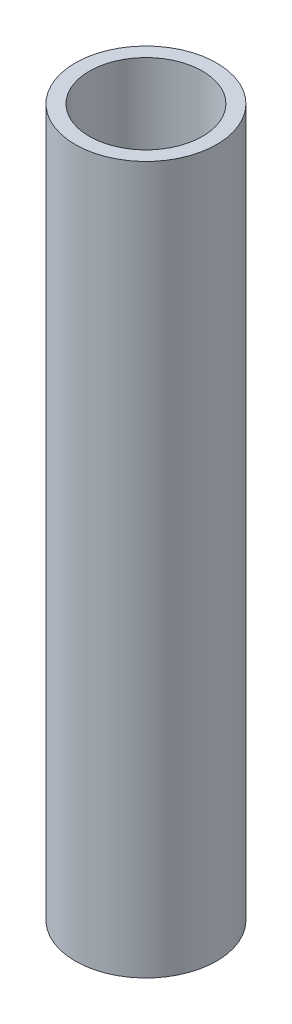
ISO-10303-21;
HEADER;
FILE_DESCRIPTION(('STEP AP214'),'2;1');
FILE_NAME('part.step','',(''),(''),'','','');
FILE_SCHEMA(('AUTOMOTIVE_DESIGN { 1 0 10303 214 1 1 1 1 }'));
ENDSEC;
DATA;
#1=APPLICATION_CONTEXT('core data for automotive mechanical design processes');
#2=APPLICATION_PROTOCOL_DEFINITION('international standard','automotive_design',2000,#1);
#3=PRODUCT_CONTEXT('',#1,'mechanical');
#4=PRODUCT('Part','Part','',(#3));
#5=PRODUCT_RELATED_PRODUCT_CATEGORY('part','',(#4));
#6=PRODUCT_DEFINITION_FORMATION('','',#4);
#7=PRODUCT_DEFINITION_CONTEXT('part definition',#1,'design');
#8=PRODUCT_DEFINITION('design','',#6,#7);
#9=PRODUCT_DEFINITION_SHAPE('','',#8);
#10=(LENGTH_UNIT() NAMED_UNIT(*) SI_UNIT(.MILLI.,.METRE.));
#11=(NAMED_UNIT(*) PLANE_ANGLE_UNIT() SI_UNIT($,.RADIAN.));
#12=(NAMED_UNIT(*) SI_UNIT($,.STERADIAN.) SOLID_ANGLE_UNIT());
#13=UNCERTAINTY_MEASURE_WITH_UNIT(LENGTH_MEASURE(1.E-05),#10,'distance_accuracy_value','');
#14=(GEOMETRIC_REPRESENTATION_CONTEXT(3) GLOBAL_UNCERTAINTY_ASSIGNED_CONTEXT((#13)) GLOBAL_UNIT_ASSIGNED_CONTEXT((#10,
#11,#12)) REPRESENTATION_CONTEXT('',''));
#15=CARTESIAN_POINT('',(0.,0.,0.));
#16=DIRECTION('',(0.,0.,1.));
#17=DIRECTION('',(1.,0.,0.));
#18=AXIS2_PLACEMENT_3D('',#15,#16,#17);
#19=CARTESIAN_POINT('',(0.,25.,0.));
#20=DIRECTION('',(0.,1.,0.));
#21=DIRECTION('',(0.,0.,1.));
#22=AXIS2_PLACEMENT_3D('',#19,#20,#21);
#23=PLANE('',#22);
#24=CARTESIAN_POINT('',(0.,25.,0.));
#25=DIRECTION('',(0.,1.,0.));
#26=DIRECTION('',(0.,0.,1.));
#27=AXIS2_PLACEMENT_3D('',#24,#25,#26);
#28=CIRCLE('',#27,5.);
#29=CARTESIAN_POINT('',(0.,25.,5.));
#30=VERTEX_POINT('',#29);
#31=EDGE_CURVE('E10',#30,#30,#28,.T.);
#32=ORIENTED_EDGE('',*,*,#31,.T.);
#33=EDGE_LOOP('',(#32));
#34=FACE_BOUND('',#33,.T.);
#35=CARTESIAN_POINT('',(0.,25.,0.));
#36=DIRECTION('',(0.,1.,0.));
#37=DIRECTION('',(0.,0.,1.));
#38=AXIS2_PLACEMENT_3D('',#35,#36,#37);
#39=CIRCLE('',#38,4.);
#40=CARTESIAN_POINT('',(0.,25.,4.));
#41=VERTEX_POINT('',#40);
#42=EDGE_CURVE('E42',#41,#41,#39,.T.);
#43=ORIENTED_EDGE('',*,*,#42,.F.);
#44=EDGE_LOOP('',(#43));
#45=FACE_BOUND('',#44,.T.);
#46=ADVANCED_FACE('F31',(#34,#45),#23,.T.);
#47=CARTESIAN_POINT('',(0.,-25.,0.));
#48=DIRECTION('',(0.,1.,0.));
#49=DIRECTION('',(0.,0.,1.));
#50=AXIS2_PLACEMENT_3D('',#47,#48,#49);
#51=PLANE('',#50);
#52=CARTESIAN_POINT('',(0.,-25.,0.));
#53=DIRECTION('',(0.,1.,0.));
#54=DIRECTION('',(0.,0.,1.));
#55=AXIS2_PLACEMENT_3D('',#52,#53,#54);
#56=CIRCLE('',#55,5.);
#57=CARTESIAN_POINT('',(0.,-25.,5.));
#58=VERTEX_POINT('',#57);
#59=EDGE_CURVE('E35',#58,#58,#56,.T.);
#60=ORIENTED_EDGE('',*,*,#59,.F.);
#61=EDGE_LOOP('',(#60));
#62=FACE_BOUND('',#61,.T.);
#63=CARTESIAN_POINT('',(0.,-25.,0.));
#64=DIRECTION('',(0.,1.,0.));
#65=DIRECTION('',(0.,0.,1.));
#66=AXIS2_PLACEMENT_3D('',#63,#64,#65);
#67=CIRCLE('',#66,4.);
#68=CARTESIAN_POINT('',(0.,-25.,4.));
#69=VERTEX_POINT('',#68);
#70=EDGE_CURVE('E44',#69,#69,#67,.T.);
#71=ORIENTED_EDGE('',*,*,#70,.T.);
#72=EDGE_LOOP('',(#71));
#73=FACE_BOUND('',#72,.T.);
#74=ADVANCED_FACE('F54',(#62,#73),#51,.F.);
#75=CARTESIAN_POINT('',(0.,25.,0.));
#76=DIRECTION('',(0.,-1.,0.));
#77=DIRECTION('',(0.,0.,-1.));
#78=AXIS2_PLACEMENT_3D('',#75,#76,#77);
#79=CYLINDRICAL_SURFACE('',#78,5.);
#80=ORIENTED_EDGE('',*,*,#31,.F.);
#81=EDGE_LOOP('',(#80));
#82=FACE_BOUND('',#81,.T.);
#83=ORIENTED_EDGE('',*,*,#59,.T.);
#84=EDGE_LOOP('',(#83));
#85=FACE_BOUND('',#84,.T.);
#86=ADVANCED_FACE('F33',(#82,#85),#79,.T.);
#87=CARTESIAN_POINT('',(0.,25.,0.));
#88=DIRECTION('',(0.,-1.,0.));
#89=DIRECTION('',(0.,0.,-1.));
#90=AXIS2_PLACEMENT_3D('',#87,#88,#89);
#91=CYLINDRICAL_SURFACE('',#90,4.);
#92=ORIENTED_EDGE('',*,*,#42,.T.);
#93=EDGE_LOOP('',(#92));
#94=FACE_BOUND('',#93,.T.);
#95=ORIENTED_EDGE('',*,*,#70,.F.);
#96=EDGE_LOOP('',(#95));
#97=FACE_BOUND('',#96,.T.);
#98=ADVANCED_FACE('F50',(#94,#97),#91,.F.);
#99=CLOSED_SHELL('',(#46,#74,#86,#98));
#100=MANIFOLD_SOLID_BREP('B2',#99);
#101=ADVANCED_BREP_SHAPE_REPRESENTATION('',(#18,#100),#14);
#102=SHAPE_DEFINITION_REPRESENTATION(#9,#101);
ENDSEC;
END-ISO-10303-21;
